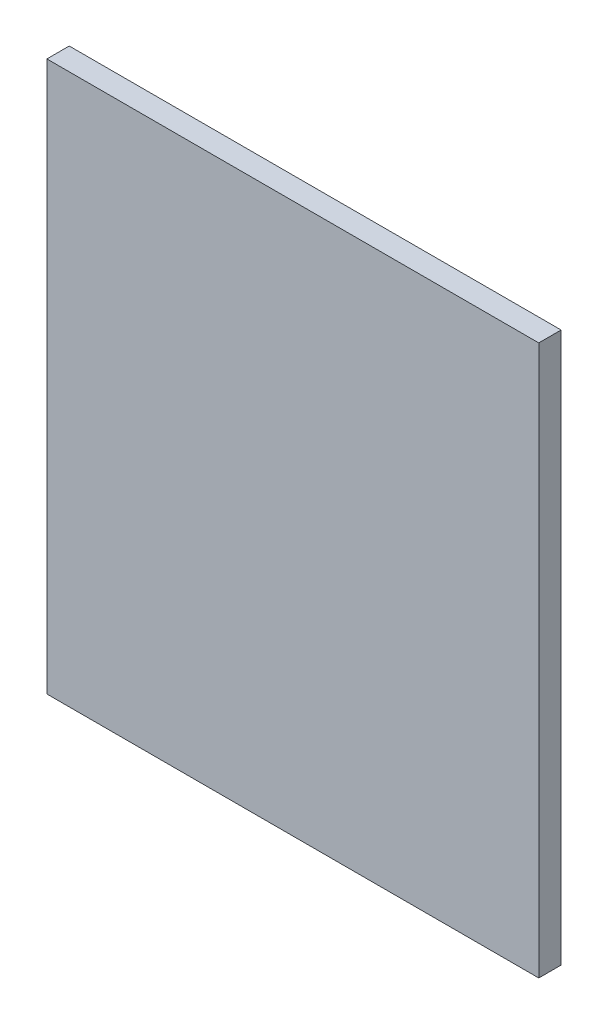
ISO-10303-21;
HEADER;
FILE_DESCRIPTION(('STEP AP214'),'2;1');
FILE_NAME('part.step','',(''),(''),'','','');
FILE_SCHEMA(('AUTOMOTIVE_DESIGN { 1 0 10303 214 1 1 1 1 }'));
ENDSEC;
DATA;
#1=APPLICATION_CONTEXT('core data for automotive mechanical design processes');
#2=APPLICATION_PROTOCOL_DEFINITION('international standard','automotive_design',2000,#1);
#3=PRODUCT_CONTEXT('',#1,'mechanical');
#4=PRODUCT('Part','Part','',(#3));
#5=PRODUCT_RELATED_PRODUCT_CATEGORY('part','',(#4));
#6=PRODUCT_DEFINITION_FORMATION('','',#4);
#7=PRODUCT_DEFINITION_CONTEXT('part definition',#1,'design');
#8=PRODUCT_DEFINITION('design','',#6,#7);
#9=PRODUCT_DEFINITION_SHAPE('','',#8);
#10=(LENGTH_UNIT() NAMED_UNIT(*) SI_UNIT(.MILLI.,.METRE.));
#11=(NAMED_UNIT(*) PLANE_ANGLE_UNIT() SI_UNIT($,.RADIAN.));
#12=(NAMED_UNIT(*) SI_UNIT($,.STERADIAN.) SOLID_ANGLE_UNIT());
#13=UNCERTAINTY_MEASURE_WITH_UNIT(LENGTH_MEASURE(1.E-05),#10,'distance_accuracy_value','');
#14=(GEOMETRIC_REPRESENTATION_CONTEXT(3) GLOBAL_UNCERTAINTY_ASSIGNED_CONTEXT((#13)) GLOBAL_UNIT_ASSIGNED_CONTEXT((#10,
#11,#12)) REPRESENTATION_CONTEXT('',''));
#15=CARTESIAN_POINT('',(0.,0.,0.));
#16=DIRECTION('',(0.,0.,1.));
#17=DIRECTION('',(1.,0.,0.));
#18=AXIS2_PLACEMENT_3D('',#15,#16,#17);
#19=CARTESIAN_POINT('',(0.,0.,6.35));
#20=DIRECTION('',(1.,0.,0.));
#21=DIRECTION('',(0.,0.,-1.));
#22=AXIS2_PLACEMENT_3D('',#19,#20,#21);
#23=PLANE('',#22);
#24=DIRECTION('',(0.,-1.,0.));
#25=VECTOR('',#24,1.);
#26=CARTESIAN_POINT('',(0.,0.,0.));
#27=LINE('',#26,#25);
#28=CARTESIAN_POINT('',(0.,156.21,0.));
#29=VERTEX_POINT('',#28);
#30=CARTESIAN_POINT('',(0.,0.,0.));
#31=VERTEX_POINT('',#30);
#32=EDGE_CURVE('E111',#29,#31,#27,.T.);
#33=ORIENTED_EDGE('',*,*,#32,.T.);
#34=DIRECTION('',(0.,0.,-1.));
#35=VECTOR('',#34,1.);
#36=CARTESIAN_POINT('',(0.,0.,6.35));
#37=LINE('',#36,#35);
#38=CARTESIAN_POINT('',(0.,0.,6.35));
#39=VERTEX_POINT('',#38);
#40=EDGE_CURVE('E11',#39,#31,#37,.T.);
#41=ORIENTED_EDGE('',*,*,#40,.F.);
#42=DIRECTION('',(0.,-1.,0.));
#43=VECTOR('',#42,1.);
#44=CARTESIAN_POINT('',(0.,0.,6.35));
#45=LINE('',#44,#43);
#46=CARTESIAN_POINT('',(0.,156.21,6.35));
#47=VERTEX_POINT('',#46);
#48=EDGE_CURVE('E95',#47,#39,#45,.T.);
#49=ORIENTED_EDGE('',*,*,#48,.F.);
#50=DIRECTION('',(0.,0.,-1.));
#51=VECTOR('',#50,1.);
#52=CARTESIAN_POINT('',(0.,156.21,6.35));
#53=LINE('',#52,#51);
#54=EDGE_CURVE('E107',#47,#29,#53,.T.);
#55=ORIENTED_EDGE('',*,*,#54,.T.);
#56=EDGE_LOOP('',(#33,#41,#49,#55));
#57=FACE_BOUND('',#56,.T.);
#58=ADVANCED_FACE('F43',(#57),#23,.F.);
#59=CARTESIAN_POINT('',(0.,0.,6.35));
#60=DIRECTION('',(0.,1.,0.));
#61=DIRECTION('',(0.,0.,1.));
#62=AXIS2_PLACEMENT_3D('',#59,#60,#61);
#63=PLANE('',#62);
#64=DIRECTION('',(1.,0.,0.));
#65=VECTOR('',#64,1.);
#66=CARTESIAN_POINT('',(0.,0.,0.));
#67=LINE('',#66,#65);
#68=CARTESIAN_POINT('',(139.7,0.,0.));
#69=VERTEX_POINT('',#68);
#70=EDGE_CURVE('E100',#31,#69,#67,.T.);
#71=ORIENTED_EDGE('',*,*,#70,.T.);
#72=DIRECTION('',(0.,0.,-1.));
#73=VECTOR('',#72,1.);
#74=CARTESIAN_POINT('',(139.7,0.,6.35));
#75=LINE('',#74,#73);
#76=CARTESIAN_POINT('',(139.7,0.,6.35));
#77=VERTEX_POINT('',#76);
#78=EDGE_CURVE('E52',#77,#69,#75,.T.);
#79=ORIENTED_EDGE('',*,*,#78,.F.);
#80=DIRECTION('',(1.,0.,0.));
#81=VECTOR('',#80,1.);
#82=CARTESIAN_POINT('',(0.,0.,6.35));
#83=LINE('',#82,#81);
#84=EDGE_CURVE('E90',#39,#77,#83,.T.);
#85=ORIENTED_EDGE('',*,*,#84,.F.);
#86=ORIENTED_EDGE('',*,*,#40,.T.);
#87=EDGE_LOOP('',(#71,#79,#85,#86));
#88=FACE_BOUND('',#87,.T.);
#89=ADVANCED_FACE('F99',(#88),#63,.F.);
#90=CARTESIAN_POINT('',(139.7,0.,6.35));
#91=DIRECTION('',(-1.,0.,0.));
#92=DIRECTION('',(0.,0.,1.));
#93=AXIS2_PLACEMENT_3D('',#90,#91,#92);
#94=PLANE('',#93);
#95=DIRECTION('',(0.,1.,0.));
#96=VECTOR('',#95,1.);
#97=CARTESIAN_POINT('',(139.7,0.,0.));
#98=LINE('',#97,#96);
#99=CARTESIAN_POINT('',(139.7,156.21,0.));
#100=VERTEX_POINT('',#99);
#101=EDGE_CURVE('E77',#69,#100,#98,.T.);
#102=ORIENTED_EDGE('',*,*,#101,.T.);
#103=DIRECTION('',(0.,0.,-1.));
#104=VECTOR('',#103,1.);
#105=CARTESIAN_POINT('',(139.7,156.21,6.35));
#106=LINE('',#105,#104);
#107=CARTESIAN_POINT('',(139.7,156.21,6.35));
#108=VERTEX_POINT('',#107);
#109=EDGE_CURVE('E102',#108,#100,#106,.T.);
#110=ORIENTED_EDGE('',*,*,#109,.F.);
#111=DIRECTION('',(0.,1.,0.));
#112=VECTOR('',#111,1.);
#113=CARTESIAN_POINT('',(139.7,0.,6.35));
#114=LINE('',#113,#112);
#115=EDGE_CURVE('E93',#77,#108,#114,.T.);
#116=ORIENTED_EDGE('',*,*,#115,.F.);
#117=ORIENTED_EDGE('',*,*,#78,.T.);
#118=EDGE_LOOP('',(#102,#110,#116,#117));
#119=FACE_BOUND('',#118,.T.);
#120=ADVANCED_FACE('F103',(#119),#94,.F.);
#121=CARTESIAN_POINT('',(0.,156.21,6.35));
#122=DIRECTION('',(0.,-1.,0.));
#123=DIRECTION('',(0.,0.,-1.));
#124=AXIS2_PLACEMENT_3D('',#121,#122,#123);
#125=PLANE('',#124);
#126=DIRECTION('',(-1.,0.,0.));
#127=VECTOR('',#126,1.);
#128=CARTESIAN_POINT('',(0.,156.21,0.));
#129=LINE('',#128,#127);
#130=EDGE_CURVE('E83',#100,#29,#129,.T.);
#131=ORIENTED_EDGE('',*,*,#130,.T.);
#132=ORIENTED_EDGE('',*,*,#54,.F.);
#133=DIRECTION('',(-1.,0.,0.));
#134=VECTOR('',#133,1.);
#135=CARTESIAN_POINT('',(0.,156.21,6.35));
#136=LINE('',#135,#134);
#137=EDGE_CURVE('E60',#108,#47,#136,.T.);
#138=ORIENTED_EDGE('',*,*,#137,.F.);
#139=ORIENTED_EDGE('',*,*,#109,.T.);
#140=EDGE_LOOP('',(#131,#132,#138,#139));
#141=FACE_BOUND('',#140,.T.);
#142=ADVANCED_FACE('F124',(#141),#125,.F.);
#143=CARTESIAN_POINT('',(0.,0.,6.35));
#144=DIRECTION('',(0.,0.,-1.));
#145=DIRECTION('',(-1.,0.,0.));
#146=AXIS2_PLACEMENT_3D('',#143,#144,#145);
#147=PLANE('',#146);
#148=ORIENTED_EDGE('',*,*,#48,.T.);
#149=ORIENTED_EDGE('',*,*,#84,.T.);
#150=ORIENTED_EDGE('',*,*,#115,.T.);
#151=ORIENTED_EDGE('',*,*,#137,.T.);
#152=EDGE_LOOP('',(#148,#149,#150,#151));
#153=FACE_BOUND('',#152,.T.);
#154=ADVANCED_FACE('F91',(#153),#147,.F.);
#155=CARTESIAN_POINT('',(0.,0.,0.));
#156=DIRECTION('',(0.,0.,-1.));
#157=DIRECTION('',(-1.,0.,0.));
#158=AXIS2_PLACEMENT_3D('',#155,#156,#157);
#159=PLANE('',#158);
#160=ORIENTED_EDGE('',*,*,#32,.F.);
#161=ORIENTED_EDGE('',*,*,#130,.F.);
#162=ORIENTED_EDGE('',*,*,#101,.F.);
#163=ORIENTED_EDGE('',*,*,#70,.F.);
#164=EDGE_LOOP('',(#160,#161,#162,#163));
#165=FACE_BOUND('',#164,.T.);
#166=ADVANCED_FACE('F127',(#165),#159,.T.);
#167=CLOSED_SHELL('',(#58,#89,#120,#142,#154,#166));
#168=MANIFOLD_SOLID_BREP('B2',#167);
#169=ADVANCED_BREP_SHAPE_REPRESENTATION('',(#18,#168),#14);
#170=SHAPE_DEFINITION_REPRESENTATION(#9,#169);
ENDSEC;
END-ISO-10303-21;
